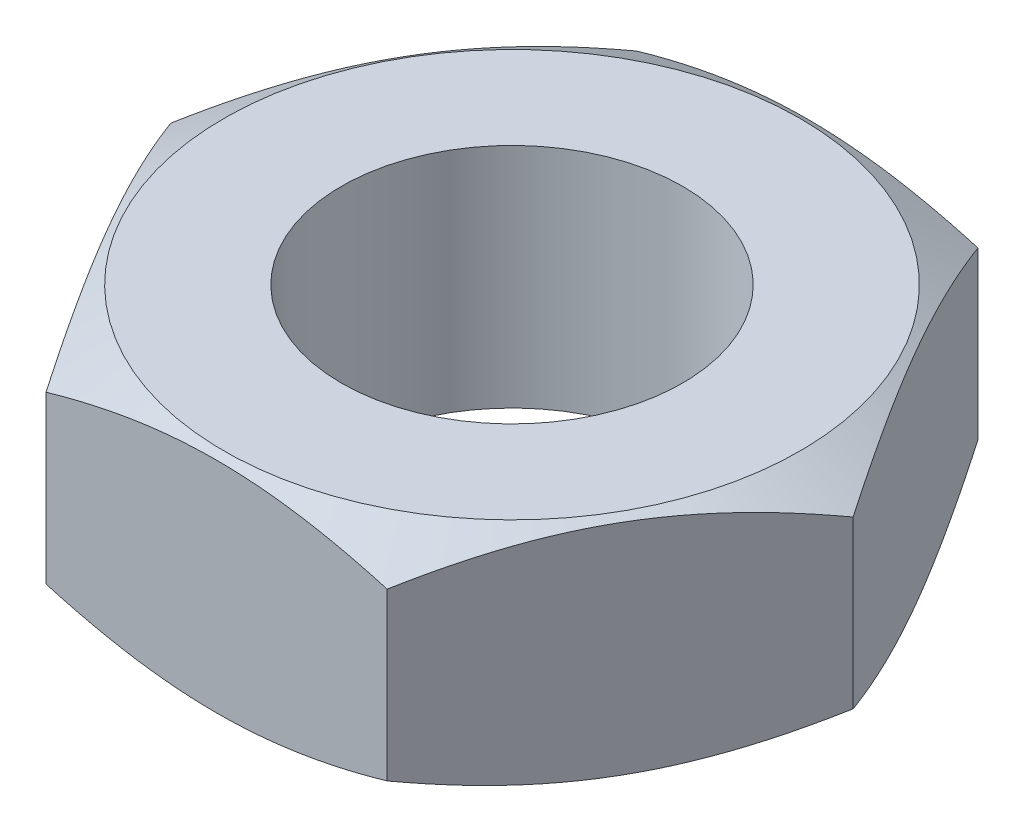
ISO-10303-21;
HEADER;
FILE_DESCRIPTION(('STEP AP214'),'2;1');
FILE_NAME('part.step','',(''),(''),'','','');
FILE_SCHEMA(('AUTOMOTIVE_DESIGN { 1 0 10303 214 1 1 1 1 }'));
ENDSEC;
DATA;
#1=APPLICATION_CONTEXT('core data for automotive mechanical design processes');
#2=APPLICATION_PROTOCOL_DEFINITION('international standard','automotive_design',2000,#1);
#3=PRODUCT_CONTEXT('',#1,'mechanical');
#4=PRODUCT('Part','Part','',(#3));
#5=PRODUCT_RELATED_PRODUCT_CATEGORY('part','',(#4));
#6=PRODUCT_DEFINITION_FORMATION('','',#4);
#7=PRODUCT_DEFINITION_CONTEXT('part definition',#1,'design');
#8=PRODUCT_DEFINITION('design','',#6,#7);
#9=PRODUCT_DEFINITION_SHAPE('','',#8);
#10=(LENGTH_UNIT() NAMED_UNIT(*) SI_UNIT(.MILLI.,.METRE.));
#11=(NAMED_UNIT(*) PLANE_ANGLE_UNIT() SI_UNIT($,.RADIAN.));
#12=(NAMED_UNIT(*) SI_UNIT($,.STERADIAN.) SOLID_ANGLE_UNIT());
#13=UNCERTAINTY_MEASURE_WITH_UNIT(LENGTH_MEASURE(1.E-05),#10,'distance_accuracy_value','');
#14=(GEOMETRIC_REPRESENTATION_CONTEXT(3) GLOBAL_UNCERTAINTY_ASSIGNED_CONTEXT((#13)) GLOBAL_UNIT_ASSIGNED_CONTEXT((#10,
#11,#12)) REPRESENTATION_CONTEXT('',''));
#15=CARTESIAN_POINT('',(0.,0.,0.));
#16=DIRECTION('',(0.,0.,1.));
#17=DIRECTION('',(1.,0.,0.));
#18=AXIS2_PLACEMENT_3D('',#15,#16,#17);
#19=CARTESIAN_POINT('',(-4.5,3.,7.79422863405995));
#20=DIRECTION('',(0.,0.,-1.));
#21=DIRECTION('',(-1.,0.,0.));
#22=AXIS2_PLACEMENT_3D('',#19,#20,#21);
#23=PLANE('',#22);
#24=CARTESIAN_POINT('',(-11.9190953068876,0.834513386120714,7.79422863405995));
#25=CARTESIAN_POINT('',(-11.5770055111038,0.669261417769259,7.79422863405995));
#26=CARTESIAN_POINT('',(-11.2341051453128,0.505656968498226,7.79422863405995));
#27=CARTESIAN_POINT('',(-10.5462449128025,0.182684930652113,7.79422863405995));
#28=CARTESIAN_POINT('',(-10.2012847004182,0.0233180791409778,7.79422863405995));
#29=CARTESIAN_POINT('',(-9.50699523730843,-0.291079909667669,7.79422863405995));
#30=CARTESIAN_POINT('',(-9.15765227127457,-0.446080869188845,7.79422863405995));
#31=CARTESIAN_POINT('',(-8.45608933800493,-0.749402664444385,7.79422863405995));
#32=CARTESIAN_POINT('',(-8.10386952232843,-0.897723849437589,7.79422863405995));
#33=CARTESIAN_POINT('',(-7.39169240053056,-1.1876403219131,7.79422863405995));
#34=CARTESIAN_POINT('',(-7.031693015999,-1.32913281977852,7.79422863405995));
#35=CARTESIAN_POINT('',(-6.30744348045875,-1.60099731893545,7.79422863405995));
#36=CARTESIAN_POINT('',(-5.9431928613815,-1.73136808231962,7.79422863405995));
#37=CARTESIAN_POINT('',(-5.21061020039826,-1.97747418680906,7.79422863405995));
#38=CARTESIAN_POINT('',(-4.84228877364945,-2.09324078028481,7.79422863405995));
#39=CARTESIAN_POINT('',(-4.10042365376642,-2.3063707416378,7.79422863405995));
#40=CARTESIAN_POINT('',(-3.72688165535778,-2.40373993927979,7.79422863405995));
#41=CARTESIAN_POINT('',(-2.9742516252831,-2.57533242392012,7.79422863405995));
#42=CARTESIAN_POINT('',(-2.59516195535838,-2.64954872320258,7.79422863405995));
#43=CARTESIAN_POINT('',(-2.02320526005688,-2.73978340623142,7.79422863405995));
#44=CARTESIAN_POINT('',(-1.83197599415599,-2.76634861042589,7.79422863405995));
#45=CARTESIAN_POINT('',(-1.44862555601179,-2.81192628103252,7.79422863405995));
#46=CARTESIAN_POINT('',(-1.2565044699217,-2.83093946224527,7.79422863405995));
#47=CARTESIAN_POINT('',(-0.872840793740873,-2.86090200878926,7.79422863405995));
#48=CARTESIAN_POINT('',(-0.681302099481684,-2.87190105902582,7.79422863405995));
#49=CARTESIAN_POINT('',(-0.297931320450094,-2.8857774592536,7.79422863405995));
#50=CARTESIAN_POINT('',(-0.106099240135938,-2.88865493145583,7.79422863405995));
#51=CARTESIAN_POINT('',(0.277460073985264,-2.88621970416352,7.79422863405995));
#52=CARTESIAN_POINT('',(0.469187322111202,-2.88090929268128,7.79422863405995));
#53=CARTESIAN_POINT('',(0.852251519599233,-2.86222995157208,7.79422863405995));
#54=CARTESIAN_POINT('',(1.0435884474926,-2.84886059006528,7.79422863405995));
#55=CARTESIAN_POINT('',(1.50768984264631,-2.80693634812311,7.79422863405995));
#56=CARTESIAN_POINT('',(1.78009487217857,-2.77432390777744,7.79422863405995));
#57=CARTESIAN_POINT('',(2.32276046031452,-2.69458384151256,7.79422863405995));
#58=CARTESIAN_POINT('',(2.59302069259299,-2.64745404865777,7.79422863405995));
#59=CARTESIAN_POINT('',(3.4010608581115,-2.48665349667927,7.79422863405995));
#60=CARTESIAN_POINT('',(3.93504330478937,-2.35367917299838,7.79422863405995));
#61=CARTESIAN_POINT('',(4.73376128442028,-2.12452148680951,7.79422863405995));
#62=CARTESIAN_POINT('',(5.00267327672863,-2.04207011337879,7.79422863405995));
#63=CARTESIAN_POINT('',(5.53789951137008,-1.86897724699556,7.79422863405995));
#64=CARTESIAN_POINT('',(5.8042135175318,-1.77833501699558,7.79422863405995));
#65=CARTESIAN_POINT('',(6.33291446917915,-1.59080039287469,7.79422863405995));
#66=CARTESIAN_POINT('',(6.59531509867915,-1.49394618614805,7.79422863405995));
#67=CARTESIAN_POINT('',(7.11788514743953,-1.29464805523161,7.79422863405995));
#68=CARTESIAN_POINT('',(7.37805530765952,-1.19220607771246,7.79422863405995));
#69=CARTESIAN_POINT('',(7.63728662867768,-1.08749367669679,7.79422863405995));
#70=B_SPLINE_CURVE_WITH_KNOTS('',3,(#24,#25,#26,#27,#28,#29,#30,#31,#32,#33,#34,#35,#36,#37,#38,
#39,#40,#41,#42,#43,#44,#45,#46,#47,#48,#49,#50,#51,#52,#53,#54,#55,#56,#57,#58,#59,#60,#61,#62,
#63,#64,#65,#66,#67,#68,#69),.UNSPECIFIED.,.F.,.F.,(4,2,2,2,2,2,2,2,2,2,2,2,2,2,2,2,2,2,2,2,2,2,
4),(0.,1.13975340008177,2.27970376261584,3.42620483893649,4.57264589951385,5.73292449000252,
6.89333205753557,8.05121268150158,9.20872577876855,10.3665878848268,10.9456590654272,
11.5246754237477,12.1000708021209,12.6754575220761,13.2506834858006,13.825940278676,
14.6485234501142,15.4712294641435,17.1198145819317,17.9635544728902,18.807370362835,
19.646420961946,20.4851810962666),.UNSPECIFIED.);
#71=CARTESIAN_POINT('',(4.5,-2.19155678068919,7.79422863405995));
#72=VERTEX_POINT('',#71);
#73=CARTESIAN_POINT('',(-4.5,-2.19155678068919,7.79422863405995));
#74=VERTEX_POINT('',#73);
#75=EDGE_CURVE('E47',#72,#74,#70,.F.);
#76=ORIENTED_EDGE('',*,*,#75,.F.);
#77=DIRECTION('',(0.,-1.,0.));
#78=VECTOR('',#77,1.);
#79=CARTESIAN_POINT('',(4.5,3.,7.79422863405995));
#80=LINE('',#79,#78);
#81=CARTESIAN_POINT('',(4.5,2.19155678068919,7.79422863405995));
#82=VERTEX_POINT('',#81);
#83=EDGE_CURVE('E11',#82,#72,#80,.T.);
#84=ORIENTED_EDGE('',*,*,#83,.F.);
#85=CARTESIAN_POINT('',(-11.9190953068876,-0.834513386120714,7.79422863405995));
#86=CARTESIAN_POINT('',(-11.5770055111038,-0.669261417769259,7.79422863405995));
#87=CARTESIAN_POINT('',(-11.2341051453128,-0.505656968498226,7.79422863405995));
#88=CARTESIAN_POINT('',(-10.5462449128025,-0.182684930652113,7.79422863405995));
#89=CARTESIAN_POINT('',(-10.2012847004182,-0.0233180791409778,7.79422863405995));
#90=CARTESIAN_POINT('',(-9.50699523730843,0.291079909667669,7.79422863405995));
#91=CARTESIAN_POINT('',(-9.15765227127457,0.446080869188845,7.79422863405995));
#92=CARTESIAN_POINT('',(-8.45608933800493,0.749402664444385,7.79422863405995));
#93=CARTESIAN_POINT('',(-8.10386952232843,0.897723849437589,7.79422863405995));
#94=CARTESIAN_POINT('',(-7.39169240053056,1.1876403219131,7.79422863405995));
#95=CARTESIAN_POINT('',(-7.031693015999,1.32913281977852,7.79422863405995));
#96=CARTESIAN_POINT('',(-6.30744348045875,1.60099731893545,7.79422863405995));
#97=CARTESIAN_POINT('',(-5.9431928613815,1.73136808231962,7.79422863405995));
#98=CARTESIAN_POINT('',(-5.21061020039826,1.97747418680906,7.79422863405995));
#99=CARTESIAN_POINT('',(-4.84228877364945,2.09324078028481,7.79422863405995));
#100=CARTESIAN_POINT('',(-4.10042365376642,2.3063707416378,7.79422863405995));
#101=CARTESIAN_POINT('',(-3.72688165535778,2.40373993927979,7.79422863405995));
#102=CARTESIAN_POINT('',(-2.9742516252831,2.57533242392012,7.79422863405995));
#103=CARTESIAN_POINT('',(-2.59516195535838,2.64954872320258,7.79422863405995));
#104=CARTESIAN_POINT('',(-2.02320526005688,2.73978340623142,7.79422863405995));
#105=CARTESIAN_POINT('',(-1.83197599415599,2.76634861042589,7.79422863405995));
#106=CARTESIAN_POINT('',(-1.44862555601179,2.81192628103252,7.79422863405995));
#107=CARTESIAN_POINT('',(-1.2565044699217,2.83093946224527,7.79422863405995));
#108=CARTESIAN_POINT('',(-0.872840793740873,2.86090200878926,7.79422863405995));
#109=CARTESIAN_POINT('',(-0.681302099481684,2.87190105902582,7.79422863405995));
#110=CARTESIAN_POINT('',(-0.297931320450094,2.8857774592536,7.79422863405995));
#111=CARTESIAN_POINT('',(-0.106099240135938,2.88865493145583,7.79422863405995));
#112=CARTESIAN_POINT('',(0.277460073985264,2.88621970416352,7.79422863405995));
#113=CARTESIAN_POINT('',(0.469187322111202,2.88090929268128,7.79422863405995));
#114=CARTESIAN_POINT('',(0.852251519599233,2.86222995157208,7.79422863405995));
#115=CARTESIAN_POINT('',(1.0435884474926,2.84886059006528,7.79422863405995));
#116=CARTESIAN_POINT('',(1.50768984264631,2.80693634812311,7.79422863405995));
#117=CARTESIAN_POINT('',(1.78009487217857,2.77432390777744,7.79422863405995));
#118=CARTESIAN_POINT('',(2.32276046031452,2.69458384151256,7.79422863405995));
#119=CARTESIAN_POINT('',(2.59302069259299,2.64745404865777,7.79422863405995));
#120=CARTESIAN_POINT('',(3.4010608581115,2.48665349667927,7.79422863405995));
#121=CARTESIAN_POINT('',(3.93504330478937,2.35367917299838,7.79422863405995));
#122=CARTESIAN_POINT('',(4.73376128442028,2.12452148680951,7.79422863405995));
#123=CARTESIAN_POINT('',(5.00267327672863,2.04207011337879,7.79422863405995));
#124=CARTESIAN_POINT('',(5.53789951137008,1.86897724699556,7.79422863405995));
#125=CARTESIAN_POINT('',(5.8042135175318,1.77833501699558,7.79422863405995));
#126=CARTESIAN_POINT('',(6.33291446917915,1.59080039287469,7.79422863405995));
#127=CARTESIAN_POINT('',(6.59531509867915,1.49394618614805,7.79422863405995));
#128=CARTESIAN_POINT('',(7.11788514743953,1.29464805523161,7.79422863405995));
#129=CARTESIAN_POINT('',(7.37805530765952,1.19220607771246,7.79422863405995));
#130=CARTESIAN_POINT('',(7.63728662867768,1.08749367669679,7.79422863405995));
#131=B_SPLINE_CURVE_WITH_KNOTS('',3,(#85,#86,#87,#88,#89,#90,#91,#92,#93,#94,#95,#96,#97,#98,
#99,#100,#101,#102,#103,#104,#105,#106,#107,#108,#109,#110,#111,#112,#113,#114,#115,#116,#117,
#118,#119,#120,#121,#122,#123,#124,#125,#126,#127,#128,#129,#130),.UNSPECIFIED.,.F.,.F.,(4,2,2,
2,2,2,2,2,2,2,2,2,2,2,2,2,2,2,2,2,2,2,4),(0.,1.13975340008177,2.27970376261584,3.42620483893649,
4.57264589951385,5.73292449000252,6.89333205753557,8.05121268150158,9.20872577876855,
10.3665878848268,10.9456590654272,11.5246754237477,12.1000708021209,12.6754575220761,
13.2506834858006,13.825940278676,14.6485234501142,15.4712294641435,17.1198145819317,
17.9635544728902,18.807370362835,19.646420961946,20.4851810962666),.UNSPECIFIED.);
#132=CARTESIAN_POINT('',(-4.5,2.19155678068919,7.79422863405995));
#133=VERTEX_POINT('',#132);
#134=EDGE_CURVE('E121',#133,#82,#131,.T.);
#135=ORIENTED_EDGE('',*,*,#134,.F.);
#136=DIRECTION('',(0.,-1.,0.));
#137=VECTOR('',#136,1.);
#138=CARTESIAN_POINT('',(-4.5,3.,7.79422863405995));
#139=LINE('',#138,#137);
#140=EDGE_CURVE('E114',#133,#74,#139,.T.);
#141=ORIENTED_EDGE('',*,*,#140,.T.);
#142=EDGE_LOOP('',(#76,#84,#135,#141));
#143=FACE_BOUND('',#142,.T.);
#144=ADVANCED_FACE('F32',(#143),#23,.F.);
#145=CARTESIAN_POINT('',(4.5,3.,7.79422863405995));
#146=DIRECTION('',(-0.866025403784438,0.,-0.5));
#147=DIRECTION('',(-0.5,0.,0.866025403784439));
#148=AXIS2_PLACEMENT_3D('',#145,#146,#147);
#149=PLANE('',#148);
#150=CARTESIAN_POINT('',(9.00011547005384,-2.19149011273954,-0.000199999999997454));
#151=CARTESIAN_POINT('',(8.90120049129361,-2.24858986602633,0.171125768842321));
#152=CARTESIAN_POINT('',(8.80191672238709,-2.3030982140379,0.343090300955337));
#153=CARTESIAN_POINT('',(8.60254289533803,-2.40621834020498,0.688415899103764));
#154=CARTESIAN_POINT('',(8.50245250907975,-2.45482757466179,0.861777533452297));
#155=CARTESIAN_POINT('',(8.20057875493599,-2.59085242364929,1.38463821310084));
#156=CARTESIAN_POINT('',(7.9976037556743,-2.66822163097211,1.73620122448834));
#157=CARTESIAN_POINT('',(7.69385559146329,-2.75894622900241,2.26230847760759));
#158=CARTESIAN_POINT('',(7.59398986719124,-2.78479105890032,2.43528098598144));
#159=CARTESIAN_POINT('',(7.39380679460617,-2.82812849623535,2.78200823851403));
#160=CARTESIAN_POINT('',(7.29348948698717,-2.8456218416301,2.95576291218866));
#161=CARTESIAN_POINT('',(7.09268213945557,-2.87181296804866,3.30357144064652));
#162=CARTESIAN_POINT('',(6.99219242580223,-2.88052073084807,3.47762473033215));
#163=CARTESIAN_POINT('',(6.79112016523209,-2.88895400714933,3.82589210163237));
#164=CARTESIAN_POINT('',(6.69053762127929,-2.88867979814958,4.00010617811315));
#165=CARTESIAN_POINT('',(6.50249472802536,-2.87977384599742,4.32580602323121));
#166=CARTESIAN_POINT('',(6.41502110941222,-2.8722285197496,4.47731477499107));
#167=CARTESIAN_POINT('',(6.24027843620094,-2.85049092622006,4.77997796324341));
#168=CARTESIAN_POINT('',(6.15300939655361,-2.8362981874781,4.93113237384033));
#169=CARTESIAN_POINT('',(5.89154043779849,-2.7840844202836,5.38400989500633));
#170=CARTESIAN_POINT('',(5.71780334111198,-2.73643434508524,5.68493137362688));
#171=CARTESIAN_POINT('',(5.36848616090657,-2.61730822996126,6.28996647769933));
#172=CARTESIAN_POINT('',(5.19295065980784,-2.54532721063699,6.59400288413439));
#173=CARTESIAN_POINT('',(4.84449737188344,-2.38196000168581,7.19754168288388));
#174=CARTESIAN_POINT('',(4.67157512270785,-2.29061218361377,7.49705180421509));
#175=CARTESIAN_POINT('',(4.49988452994616,-2.19149011273953,7.79442863405995));
#176=B_SPLINE_CURVE_WITH_KNOTS('',3,(#150,#151,#152,#153,#154,#155,#156,#157,#158,#159,#160,
#161,#162,#163,#164,#165,#166,#167,#168,#169,#170,#171,#172,#173,#174,#175),.UNSPECIFIED.,.F.,
.F.,(4,2,2,2,2,2,2,2,2,2,2,2,4),(0.,0.617667126704347,1.23559965230367,2.47403233296678,
3.07808164625473,3.6820775743811,4.28538649467425,4.88867677573061,5.41387548857204,
5.93911145618208,6.99032972891176,8.06486213809553,9.13728513994542),.UNSPECIFIED.);
#177=CARTESIAN_POINT('',(9.,-2.19155678068919,0.));
#178=VERTEX_POINT('',#177);
#179=EDGE_CURVE('E102',#178,#72,#176,.T.);
#180=ORIENTED_EDGE('',*,*,#179,.F.);
#181=DIRECTION('',(0.,-1.,0.));
#182=VECTOR('',#181,1.);
#183=CARTESIAN_POINT('',(9.,3.,0.));
#184=LINE('',#183,#182);
#185=CARTESIAN_POINT('',(9.,2.19155678068919,0.));
#186=VERTEX_POINT('',#185);
#187=EDGE_CURVE('E40',#186,#178,#184,.T.);
#188=ORIENTED_EDGE('',*,*,#187,.F.);
#189=CARTESIAN_POINT('',(4.49988452994616,2.19149011273953,7.79442863405995));
#190=CARTESIAN_POINT('',(4.59879950870639,2.24858986602633,7.62310286521763));
#191=CARTESIAN_POINT('',(4.69808327761291,2.3030982140379,7.45113833310462));
#192=CARTESIAN_POINT('',(4.89745710466197,2.40621834020498,7.10581273495619));
#193=CARTESIAN_POINT('',(4.99754749092025,2.45482757466179,6.93245110060766));
#194=CARTESIAN_POINT('',(5.29942124506401,2.59085242364929,6.40959042095912));
#195=CARTESIAN_POINT('',(5.5023962443257,2.66822163097211,6.05802740957161));
#196=CARTESIAN_POINT('',(5.80614440853671,2.75894622900241,5.53192015645237));
#197=CARTESIAN_POINT('',(5.90601013280876,2.78479105890032,5.35894764807852));
#198=CARTESIAN_POINT('',(6.10619320539383,2.82812849623534,5.01222039554592));
#199=CARTESIAN_POINT('',(6.20651051301283,2.8456218416301,4.8384657218713));
#200=CARTESIAN_POINT('',(6.40731786054443,2.87181296804866,4.49065719341343));
#201=CARTESIAN_POINT('',(6.50780757419777,2.88052073084807,4.3166039037278));
#202=CARTESIAN_POINT('',(6.70887983476791,2.88895400714933,3.96833653242759));
#203=CARTESIAN_POINT('',(6.80946237872071,2.88867979814958,3.79412245594681));
#204=CARTESIAN_POINT('',(6.99750527197464,2.87977384599742,3.46842261082874));
#205=CARTESIAN_POINT('',(7.08497889058778,2.8722285197496,3.31691385906888));
#206=CARTESIAN_POINT('',(7.25972156379906,2.85049092622006,3.01425067081654));
#207=CARTESIAN_POINT('',(7.34699060344639,2.8362981874781,2.86309626021963));
#208=CARTESIAN_POINT('',(7.60845956220151,2.7840844202836,2.41021873905363));
#209=CARTESIAN_POINT('',(7.78219665888802,2.73643434508524,2.10929726043308));
#210=CARTESIAN_POINT('',(8.13151383909343,2.61730822996126,1.50426215636062));
#211=CARTESIAN_POINT('',(8.30704934019216,2.54532721063699,1.20022574992556));
#212=CARTESIAN_POINT('',(8.65550262811656,2.38196000168581,0.596686951176075));
#213=CARTESIAN_POINT('',(8.82842487729215,2.29061218361377,0.297176829844865));
#214=CARTESIAN_POINT('',(9.00011547005384,2.19149011273954,-0.000199999999996476));
#215=B_SPLINE_CURVE_WITH_KNOTS('',3,(#189,#190,#191,#192,#193,#194,#195,#196,#197,#198,#199,
#200,#201,#202,#203,#204,#205,#206,#207,#208,#209,#210,#211,#212,#213,#214),.UNSPECIFIED.,.F.,
.F.,(4,2,2,2,2,2,2,2,2,2,2,2,4),(0.,0.617667126704346,1.23559965230366,2.47403233296678,
3.07808164625473,3.6820775743811,4.28538649467425,4.88867677573061,5.41387548857204,
5.93911145618208,6.99032972891176,8.06486213809553,9.13728513994542),.UNSPECIFIED.);
#216=EDGE_CURVE('E129',#82,#186,#215,.T.);
#217=ORIENTED_EDGE('',*,*,#216,.F.);
#218=ORIENTED_EDGE('',*,*,#83,.T.);
#219=EDGE_LOOP('',(#180,#188,#217,#218));
#220=FACE_BOUND('',#219,.T.);
#221=ADVANCED_FACE('F172',(#220),#149,.F.);
#222=CARTESIAN_POINT('',(9.,3.,0.));
#223=DIRECTION('',(-0.866025403784439,0.,0.5));
#224=DIRECTION('',(0.5,0.,0.866025403784439));
#225=AXIS2_PLACEMENT_3D('',#222,#223,#224);
#226=PLANE('',#225);
#227=CARTESIAN_POINT('',(4.49988452994616,-2.19149011273953,-7.79442863405995));
#228=CARTESIAN_POINT('',(4.5987995087064,-2.24858986602633,-7.62310286521763));
#229=CARTESIAN_POINT('',(4.69808327761291,-2.3030982140379,-7.45113833310462));
#230=CARTESIAN_POINT('',(4.89745710466197,-2.40621834020498,-7.10581273495619));
#231=CARTESIAN_POINT('',(4.99754749092025,-2.45482757466179,-6.93245110060766));
#232=CARTESIAN_POINT('',(5.29942124506401,-2.59085242364929,-6.40959042095912));
#233=CARTESIAN_POINT('',(5.5023962443257,-2.66822163097211,-6.05802740957161));
#234=CARTESIAN_POINT('',(5.80614440853671,-2.75894622900241,-5.53192015645236));
#235=CARTESIAN_POINT('',(5.90601013280876,-2.78479105890032,-5.35894764807852));
#236=CARTESIAN_POINT('',(6.10619320539383,-2.82812849623535,-5.01222039554592));
#237=CARTESIAN_POINT('',(6.20651051301283,-2.8456218416301,-4.83846572187129));
#238=CARTESIAN_POINT('',(6.40731786054443,-2.87181296804866,-4.49065719341343));
#239=CARTESIAN_POINT('',(6.50780757419777,-2.88052073084807,-4.3166039037278));
#240=CARTESIAN_POINT('',(6.70887983476791,-2.88895400714933,-3.96833653242759));
#241=CARTESIAN_POINT('',(6.80946237872071,-2.88867979814958,-3.7941224559468));
#242=CARTESIAN_POINT('',(6.99750527197464,-2.87977384599742,-3.46842261082874));
#243=CARTESIAN_POINT('',(7.08497889058778,-2.8722285197496,-3.31691385906888));
#244=CARTESIAN_POINT('',(7.25972156379906,-2.85049092622006,-3.01425067081654));
#245=CARTESIAN_POINT('',(7.34699060344639,-2.8362981874781,-2.86309626021962));
#246=CARTESIAN_POINT('',(7.60845956220151,-2.7840844202836,-2.41021873905362));
#247=CARTESIAN_POINT('',(7.78219665888802,-2.73643434508524,-2.10929726043308));
#248=CARTESIAN_POINT('',(8.13151383909343,-2.61730822996126,-1.50426215636062));
#249=CARTESIAN_POINT('',(8.30704934019216,-2.54532721063699,-1.20022574992556));
#250=CARTESIAN_POINT('',(8.65550262811656,-2.38196000168581,-0.596686951176069));
#251=CARTESIAN_POINT('',(8.82842487729215,-2.29061218361377,-0.297176829844858));
#252=CARTESIAN_POINT('',(9.00011547005384,-2.19149011273954,0.000200000000002919));
#253=B_SPLINE_CURVE_WITH_KNOTS('',3,(#227,#228,#229,#230,#231,#232,#233,#234,#235,#236,#237,
#238,#239,#240,#241,#242,#243,#244,#245,#246,#247,#248,#249,#250,#251,#252),.UNSPECIFIED.,.F.,
.F.,(4,2,2,2,2,2,2,2,2,2,2,2,4),(0.,0.617667126704345,1.23559965230366,2.47403233296678,
3.07808164625473,3.6820775743811,4.28538649467425,4.88867677573061,5.41387548857204,
5.93911145618208,6.99032972891176,8.06486213809553,9.13728513994543),.UNSPECIFIED.);
#254=CARTESIAN_POINT('',(4.5,-2.19155678068919,-7.79422863405995));
#255=VERTEX_POINT('',#254);
#256=EDGE_CURVE('E86',#255,#178,#253,.T.);
#257=ORIENTED_EDGE('',*,*,#256,.F.);
#258=DIRECTION('',(0.,-1.,0.));
#259=VECTOR('',#258,1.);
#260=CARTESIAN_POINT('',(4.5,3.,-7.79422863405995));
#261=LINE('',#260,#259);
#262=CARTESIAN_POINT('',(4.5,2.19155678068919,-7.79422863405995));
#263=VERTEX_POINT('',#262);
#264=EDGE_CURVE('E100',#263,#255,#261,.T.);
#265=ORIENTED_EDGE('',*,*,#264,.F.);
#266=CARTESIAN_POINT('',(9.00011547005384,2.19149011273954,0.000200000000002611));
#267=CARTESIAN_POINT('',(8.90120049129361,2.24858986602633,-0.171125768842316));
#268=CARTESIAN_POINT('',(8.80191672238709,2.3030982140379,-0.343090300955332));
#269=CARTESIAN_POINT('',(8.60254289533803,2.40621834020498,-0.688415899103759));
#270=CARTESIAN_POINT('',(8.50245250907975,2.45482757466179,-0.861777533452292));
#271=CARTESIAN_POINT('',(8.20057875493599,2.59085242364929,-1.38463821310083));
#272=CARTESIAN_POINT('',(7.9976037556743,2.6682216309721,-1.73620122448834));
#273=CARTESIAN_POINT('',(7.69385559146329,2.75894622900241,-2.26230847760758));
#274=CARTESIAN_POINT('',(7.59398986719124,2.78479105890032,-2.43528098598143));
#275=CARTESIAN_POINT('',(7.39380679460617,2.82812849623535,-2.78200823851403));
#276=CARTESIAN_POINT('',(7.29348948698717,2.8456218416301,-2.95576291218865));
#277=CARTESIAN_POINT('',(7.09268213945557,2.87181296804866,-3.30357144064652));
#278=CARTESIAN_POINT('',(6.99219242580223,2.88052073084807,-3.47762473033215));
#279=CARTESIAN_POINT('',(6.79112016523209,2.88895400714933,-3.82589210163236));
#280=CARTESIAN_POINT('',(6.69053762127929,2.88867979814958,-4.00010617811314));
#281=CARTESIAN_POINT('',(6.50249472802536,2.87977384599742,-4.32580602323121));
#282=CARTESIAN_POINT('',(6.41502110941222,2.8722285197496,-4.47731477499107));
#283=CARTESIAN_POINT('',(6.24027843620094,2.85049092622006,-4.77997796324341));
#284=CARTESIAN_POINT('',(6.15300939655361,2.8362981874781,-4.93113237384032));
#285=CARTESIAN_POINT('',(5.89154043779849,2.78408442028361,-5.38400989500632));
#286=CARTESIAN_POINT('',(5.71780334111198,2.73643434508524,-5.68493137362687));
#287=CARTESIAN_POINT('',(5.36848616090657,2.61730822996126,-6.28996647769933));
#288=CARTESIAN_POINT('',(5.19295065980784,2.54532721063699,-6.59400288413439));
#289=CARTESIAN_POINT('',(4.84449737188344,2.38196000168581,-7.19754168288388));
#290=CARTESIAN_POINT('',(4.67157512270785,2.29061218361377,-7.49705180421509));
#291=CARTESIAN_POINT('',(4.49988452994616,2.19149011273953,-7.79442863405995));
#292=B_SPLINE_CURVE_WITH_KNOTS('',3,(#266,#267,#268,#269,#270,#271,#272,#273,#274,#275,#276,
#277,#278,#279,#280,#281,#282,#283,#284,#285,#286,#287,#288,#289,#290,#291),.UNSPECIFIED.,.F.,
.F.,(4,2,2,2,2,2,2,2,2,2,2,2,4),(0.,0.617667126704347,1.23559965230367,2.47403233296678,
3.07808164625473,3.6820775743811,4.28538649467425,4.88867677573061,5.41387548857204,
5.93911145618208,6.99032972891176,8.06486213809553,9.13728513994543),.UNSPECIFIED.);
#293=EDGE_CURVE('E165',#186,#263,#292,.T.);
#294=ORIENTED_EDGE('',*,*,#293,.F.);
#295=ORIENTED_EDGE('',*,*,#187,.T.);
#296=EDGE_LOOP('',(#257,#265,#294,#295));
#297=FACE_BOUND('',#296,.T.);
#298=ADVANCED_FACE('F98',(#297),#226,.F.);
#299=CARTESIAN_POINT('',(4.5,3.,-7.79422863405995));
#300=DIRECTION('',(0.,0.,1.));
#301=DIRECTION('',(1.,0.,0.));
#302=AXIS2_PLACEMENT_3D('',#299,#300,#301);
#303=PLANE('',#302);
#304=CARTESIAN_POINT('',(-11.9190953068876,0.834513386120714,-7.79422863405995));
#305=CARTESIAN_POINT('',(-11.5770055111038,0.66926141776926,-7.79422863405995));
#306=CARTESIAN_POINT('',(-11.2341051453128,0.505656968498228,-7.79422863405995));
#307=CARTESIAN_POINT('',(-10.5462449128025,0.182684930652115,-7.79422863405995));
#308=CARTESIAN_POINT('',(-10.2012847004182,0.02331807914098,-7.79422863405995));
#309=CARTESIAN_POINT('',(-9.50699523730843,-0.291079909667667,-7.79422863405995));
#310=CARTESIAN_POINT('',(-9.15765227127457,-0.446080869188844,-7.79422863405995));
#311=CARTESIAN_POINT('',(-8.45608933800493,-0.749402664444383,-7.79422863405995));
#312=CARTESIAN_POINT('',(-8.10386952232844,-0.897723849437586,-7.79422863405995));
#313=CARTESIAN_POINT('',(-7.39169240053056,-1.1876403219131,-7.79422863405995));
#314=CARTESIAN_POINT('',(-7.031693015999,-1.32913281977852,-7.79422863405995));
#315=CARTESIAN_POINT('',(-6.30744348045876,-1.60099731893544,-7.79422863405995));
#316=CARTESIAN_POINT('',(-5.9431928613815,-1.73136808231962,-7.79422863405995));
#317=CARTESIAN_POINT('',(-5.21061020039826,-1.97747418680906,-7.79422863405995));
#318=CARTESIAN_POINT('',(-4.84228877364945,-2.09324078028481,-7.79422863405995));
#319=CARTESIAN_POINT('',(-4.10042365376641,-2.3063707416378,-7.79422863405995));
#320=CARTESIAN_POINT('',(-3.72688165535777,-2.40373993927979,-7.79422863405995));
#321=CARTESIAN_POINT('',(-2.9742516252831,-2.57533242392012,-7.79422863405995));
#322=CARTESIAN_POINT('',(-2.59516195535838,-2.64954872320258,-7.79422863405995));
#323=CARTESIAN_POINT('',(-2.02320526005688,-2.73978340623142,-7.79422863405995));
#324=CARTESIAN_POINT('',(-1.83197599415599,-2.76634861042589,-7.79422863405995));
#325=CARTESIAN_POINT('',(-1.44862555601178,-2.81192628103252,-7.79422863405995));
#326=CARTESIAN_POINT('',(-1.2565044699217,-2.83093946224527,-7.79422863405995));
#327=CARTESIAN_POINT('',(-0.872840793740868,-2.86090200878926,-7.79422863405995));
#328=CARTESIAN_POINT('',(-0.681302099481679,-2.87190105902582,-7.79422863405995));
#329=CARTESIAN_POINT('',(-0.297931320450089,-2.8857774592536,-7.79422863405995));
#330=CARTESIAN_POINT('',(-0.106099240135932,-2.88865493145583,-7.79422863405995));
#331=CARTESIAN_POINT('',(0.277460073985269,-2.88621970416352,-7.79422863405995));
#332=CARTESIAN_POINT('',(0.469187322111207,-2.88090929268128,-7.79422863405995));
#333=CARTESIAN_POINT('',(0.852251519599238,-2.86222995157208,-7.79422863405995));
#334=CARTESIAN_POINT('',(1.04358844749261,-2.84886059006528,-7.79422863405995));
#335=CARTESIAN_POINT('',(1.50768984264631,-2.80693634812311,-7.79422863405995));
#336=CARTESIAN_POINT('',(1.78009487217857,-2.77432390777744,-7.79422863405995));
#337=CARTESIAN_POINT('',(2.32276046031452,-2.69458384151256,-7.79422863405995));
#338=CARTESIAN_POINT('',(2.593020692593,-2.64745404865777,-7.79422863405995));
#339=CARTESIAN_POINT('',(3.4010608581115,-2.48665349667927,-7.79422863405995));
#340=CARTESIAN_POINT('',(3.93504330478937,-2.35367917299838,-7.79422863405995));
#341=CARTESIAN_POINT('',(4.73376128442028,-2.12452148680951,-7.79422863405995));
#342=CARTESIAN_POINT('',(5.00267327672863,-2.04207011337879,-7.79422863405995));
#343=CARTESIAN_POINT('',(5.53789951137008,-1.86897724699556,-7.79422863405995));
#344=CARTESIAN_POINT('',(5.80421351753181,-1.77833501699558,-7.79422863405995));
#345=CARTESIAN_POINT('',(6.33291446917915,-1.59080039287469,-7.79422863405995));
#346=CARTESIAN_POINT('',(6.59531509867916,-1.49394618614805,-7.79422863405995));
#347=CARTESIAN_POINT('',(7.11788514743954,-1.29464805523161,-7.79422863405995));
#348=CARTESIAN_POINT('',(7.37805530765953,-1.19220607771246,-7.79422863405995));
#349=CARTESIAN_POINT('',(7.63728662867769,-1.08749367669679,-7.79422863405995));
#350=B_SPLINE_CURVE_WITH_KNOTS('',3,(#304,#305,#306,#307,#308,#309,#310,#311,#312,#313,#314,
#315,#316,#317,#318,#319,#320,#321,#322,#323,#324,#325,#326,#327,#328,#329,#330,#331,#332,#333,
#334,#335,#336,#337,#338,#339,#340,#341,#342,#343,#344,#345,#346,#347,#348,#349),.UNSPECIFIED.,
.F.,.F.,(4,2,2,2,2,2,2,2,2,2,2,2,2,2,2,2,2,2,2,2,2,2,4),(0.,1.13975340008177,2.27970376261583,
3.42620483893649,4.57264589951385,5.73292449000251,6.89333205753557,8.05121268150158,
9.20872577876855,10.3665878848268,10.9456590654272,11.5246754237477,12.1000708021209,
12.6754575220761,13.2506834858007,13.825940278676,14.6485234501142,15.4712294641435,
17.1198145819317,17.9635544728902,18.807370362835,19.646420961946,20.4851810962666),.UNSPECIFIED.);
#351=CARTESIAN_POINT('',(-4.5,-2.19155678068919,-7.79422863405995));
#352=VERTEX_POINT('',#351);
#353=EDGE_CURVE('E83',#352,#255,#350,.T.);
#354=ORIENTED_EDGE('',*,*,#353,.F.);
#355=DIRECTION('',(0.,-1.,0.));
#356=VECTOR('',#355,1.);
#357=CARTESIAN_POINT('',(-4.5,3.,-7.79422863405995));
#358=LINE('',#357,#356);
#359=CARTESIAN_POINT('',(-4.5,2.19155678068919,-7.79422863405995));
#360=VERTEX_POINT('',#359);
#361=EDGE_CURVE('E107',#360,#352,#358,.T.);
#362=ORIENTED_EDGE('',*,*,#361,.F.);
#363=CARTESIAN_POINT('',(-11.9190953068876,-0.834513386120714,-7.79422863405995));
#364=CARTESIAN_POINT('',(-11.5770055111038,-0.66926141776926,-7.79422863405995));
#365=CARTESIAN_POINT('',(-11.2341051453128,-0.505656968498228,-7.79422863405995));
#366=CARTESIAN_POINT('',(-10.5462449128025,-0.182684930652115,-7.79422863405995));
#367=CARTESIAN_POINT('',(-10.2012847004182,-0.02331807914098,-7.79422863405995));
#368=CARTESIAN_POINT('',(-9.50699523730843,0.291079909667667,-7.79422863405995));
#369=CARTESIAN_POINT('',(-9.15765227127457,0.446080869188844,-7.79422863405995));
#370=CARTESIAN_POINT('',(-8.45608933800493,0.749402664444383,-7.79422863405995));
#371=CARTESIAN_POINT('',(-8.10386952232844,0.897723849437586,-7.79422863405995));
#372=CARTESIAN_POINT('',(-7.39169240053056,1.1876403219131,-7.79422863405995));
#373=CARTESIAN_POINT('',(-7.031693015999,1.32913281977852,-7.79422863405995));
#374=CARTESIAN_POINT('',(-6.30744348045876,1.60099731893544,-7.79422863405995));
#375=CARTESIAN_POINT('',(-5.9431928613815,1.73136808231962,-7.79422863405995));
#376=CARTESIAN_POINT('',(-5.21061020039826,1.97747418680906,-7.79422863405995));
#377=CARTESIAN_POINT('',(-4.84228877364945,2.09324078028481,-7.79422863405995));
#378=CARTESIAN_POINT('',(-4.10042365376641,2.3063707416378,-7.79422863405995));
#379=CARTESIAN_POINT('',(-3.72688165535777,2.40373993927979,-7.79422863405995));
#380=CARTESIAN_POINT('',(-2.9742516252831,2.57533242392012,-7.79422863405995));
#381=CARTESIAN_POINT('',(-2.59516195535838,2.64954872320258,-7.79422863405995));
#382=CARTESIAN_POINT('',(-2.02320526005688,2.73978340623142,-7.79422863405995));
#383=CARTESIAN_POINT('',(-1.83197599415599,2.76634861042589,-7.79422863405995));
#384=CARTESIAN_POINT('',(-1.44862555601178,2.81192628103252,-7.79422863405995));
#385=CARTESIAN_POINT('',(-1.2565044699217,2.83093946224527,-7.79422863405995));
#386=CARTESIAN_POINT('',(-0.872840793740868,2.86090200878926,-7.79422863405995));
#387=CARTESIAN_POINT('',(-0.681302099481679,2.87190105902582,-7.79422863405995));
#388=CARTESIAN_POINT('',(-0.297931320450089,2.8857774592536,-7.79422863405995));
#389=CARTESIAN_POINT('',(-0.106099240135932,2.88865493145583,-7.79422863405995));
#390=CARTESIAN_POINT('',(0.277460073985269,2.88621970416352,-7.79422863405995));
#391=CARTESIAN_POINT('',(0.469187322111207,2.88090929268128,-7.79422863405995));
#392=CARTESIAN_POINT('',(0.852251519599238,2.86222995157208,-7.79422863405995));
#393=CARTESIAN_POINT('',(1.04358844749261,2.84886059006528,-7.79422863405995));
#394=CARTESIAN_POINT('',(1.50768984264631,2.80693634812311,-7.79422863405995));
#395=CARTESIAN_POINT('',(1.78009487217857,2.77432390777744,-7.79422863405995));
#396=CARTESIAN_POINT('',(2.32276046031452,2.69458384151256,-7.79422863405995));
#397=CARTESIAN_POINT('',(2.593020692593,2.64745404865777,-7.79422863405995));
#398=CARTESIAN_POINT('',(3.4010608581115,2.48665349667927,-7.79422863405995));
#399=CARTESIAN_POINT('',(3.93504330478937,2.35367917299838,-7.79422863405995));
#400=CARTESIAN_POINT('',(4.73376128442028,2.12452148680951,-7.79422863405995));
#401=CARTESIAN_POINT('',(5.00267327672863,2.04207011337879,-7.79422863405995));
#402=CARTESIAN_POINT('',(5.53789951137008,1.86897724699556,-7.79422863405995));
#403=CARTESIAN_POINT('',(5.80421351753181,1.77833501699558,-7.79422863405995));
#404=CARTESIAN_POINT('',(6.33291446917915,1.59080039287469,-7.79422863405995));
#405=CARTESIAN_POINT('',(6.59531509867916,1.49394618614805,-7.79422863405995));
#406=CARTESIAN_POINT('',(7.11788514743954,1.29464805523161,-7.79422863405995));
#407=CARTESIAN_POINT('',(7.37805530765953,1.19220607771246,-7.79422863405995));
#408=CARTESIAN_POINT('',(7.63728662867769,1.08749367669679,-7.79422863405995));
#409=B_SPLINE_CURVE_WITH_KNOTS('',3,(#363,#364,#365,#366,#367,#368,#369,#370,#371,#372,#373,
#374,#375,#376,#377,#378,#379,#380,#381,#382,#383,#384,#385,#386,#387,#388,#389,#390,#391,#392,
#393,#394,#395,#396,#397,#398,#399,#400,#401,#402,#403,#404,#405,#406,#407,#408),.UNSPECIFIED.,
.F.,.F.,(4,2,2,2,2,2,2,2,2,2,2,2,2,2,2,2,2,2,2,2,2,2,4),(0.,1.13975340008177,2.27970376261583,
3.42620483893649,4.57264589951385,5.73292449000251,6.89333205753557,8.05121268150158,
9.20872577876855,10.3665878848268,10.9456590654272,11.5246754237477,12.1000708021209,
12.6754575220761,13.2506834858007,13.825940278676,14.6485234501142,15.4712294641435,
17.1198145819317,17.9635544728902,18.807370362835,19.646420961946,20.4851810962666),.UNSPECIFIED.);
#410=EDGE_CURVE('E106',#263,#360,#409,.F.);
#411=ORIENTED_EDGE('',*,*,#410,.F.);
#412=ORIENTED_EDGE('',*,*,#264,.T.);
#413=EDGE_LOOP('',(#354,#362,#411,#412));
#414=FACE_BOUND('',#413,.T.);
#415=ADVANCED_FACE('F105',(#414),#303,.F.);
#416=CARTESIAN_POINT('',(-4.5,3.,-7.79422863405995));
#417=DIRECTION('',(0.866025403784439,0.,0.5));
#418=DIRECTION('',(0.5,0.,-0.866025403784439));
#419=AXIS2_PLACEMENT_3D('',#416,#417,#418);
#420=PLANE('',#419);
#421=CARTESIAN_POINT('',(-9.00011547005384,-2.19149011273954,0.000200000000000536));
#422=CARTESIAN_POINT('',(-8.90120049129361,-2.24858986602633,-0.171125768842318));
#423=CARTESIAN_POINT('',(-8.80191672238709,-2.3030982140379,-0.343090300955334));
#424=CARTESIAN_POINT('',(-8.60254289533803,-2.40621834020498,-0.688415899103761));
#425=CARTESIAN_POINT('',(-8.50245250907975,-2.45482757466179,-0.861777533452293));
#426=CARTESIAN_POINT('',(-8.20057875493599,-2.59085242364929,-1.38463821310083));
#427=CARTESIAN_POINT('',(-7.9976037556743,-2.6682216309721,-1.73620122448834));
#428=CARTESIAN_POINT('',(-7.69385559146329,-2.75894622900241,-2.26230847760759));
#429=CARTESIAN_POINT('',(-7.59398986719124,-2.78479105890032,-2.43528098598143));
#430=CARTESIAN_POINT('',(-7.39380679460617,-2.82812849623535,-2.78200823851403));
#431=CARTESIAN_POINT('',(-7.29348948698717,-2.8456218416301,-2.95576291218865));
#432=CARTESIAN_POINT('',(-7.09268213945557,-2.87181296804866,-3.30357144064652));
#433=CARTESIAN_POINT('',(-6.99219242580223,-2.88052073084807,-3.47762473033215));
#434=CARTESIAN_POINT('',(-6.79112016523209,-2.88895400714933,-3.82589210163236));
#435=CARTESIAN_POINT('',(-6.69053762127929,-2.88867979814958,-4.00010617811314));
#436=CARTESIAN_POINT('',(-6.50249472802536,-2.87977384599742,-4.32580602323121));
#437=CARTESIAN_POINT('',(-6.41502110941222,-2.8722285197496,-4.47731477499107));
#438=CARTESIAN_POINT('',(-6.24027843620094,-2.85049092622006,-4.77997796324341));
#439=CARTESIAN_POINT('',(-6.15300939655361,-2.8362981874781,-4.93113237384032));
#440=CARTESIAN_POINT('',(-5.89154043779849,-2.78408442028361,-5.38400989500633));
#441=CARTESIAN_POINT('',(-5.71780334111197,-2.73643434508524,-5.68493137362687));
#442=CARTESIAN_POINT('',(-5.36848616090657,-2.61730822996126,-6.28996647769933));
#443=CARTESIAN_POINT('',(-5.19295065980784,-2.54532721063699,-6.59400288413439));
#444=CARTESIAN_POINT('',(-4.84449737188344,-2.38196000168581,-7.19754168288388));
#445=CARTESIAN_POINT('',(-4.67157512270785,-2.29061218361377,-7.49705180421509));
#446=CARTESIAN_POINT('',(-4.49988452994616,-2.19149011273954,-7.79442863405995));
#447=B_SPLINE_CURVE_WITH_KNOTS('',3,(#421,#422,#423,#424,#425,#426,#427,#428,#429,#430,#431,
#432,#433,#434,#435,#436,#437,#438,#439,#440,#441,#442,#443,#444,#445,#446),.UNSPECIFIED.,.F.,
.F.,(4,2,2,2,2,2,2,2,2,2,2,2,4),(0.,0.617667126704347,1.23559965230366,2.47403233296678,
3.07808164625473,3.6820775743811,4.28538649467425,4.88867677573061,5.41387548857204,
5.93911145618208,6.99032972891176,8.06486213809553,9.13728513994543),.UNSPECIFIED.);
#448=CARTESIAN_POINT('',(-9.,-2.19155678068919,0.));
#449=VERTEX_POINT('',#448);
#450=EDGE_CURVE('E89',#449,#352,#447,.T.);
#451=ORIENTED_EDGE('',*,*,#450,.F.);
#452=DIRECTION('',(0.,-1.,0.));
#453=VECTOR('',#452,1.);
#454=CARTESIAN_POINT('',(-9.,3.,0.));
#455=LINE('',#454,#453);
#456=CARTESIAN_POINT('',(-9.,2.19155678068919,0.));
#457=VERTEX_POINT('',#456);
#458=EDGE_CURVE('E109',#457,#449,#455,.T.);
#459=ORIENTED_EDGE('',*,*,#458,.F.);
#460=CARTESIAN_POINT('',(-4.49988452994616,2.19149011273954,-7.79442863405995));
#461=CARTESIAN_POINT('',(-4.59879950870639,2.24858986602633,-7.62310286521763));
#462=CARTESIAN_POINT('',(-4.69808327761291,2.3030982140379,-7.45113833310462));
#463=CARTESIAN_POINT('',(-4.89745710466197,2.40621834020498,-7.10581273495619));
#464=CARTESIAN_POINT('',(-4.99754749092025,2.45482757466179,-6.93245110060766));
#465=CARTESIAN_POINT('',(-5.299421245064,2.59085242364929,-6.40959042095912));
#466=CARTESIAN_POINT('',(-5.5023962443257,2.66822163097211,-6.05802740957161));
#467=CARTESIAN_POINT('',(-5.80614440853671,2.75894622900241,-5.53192015645237));
#468=CARTESIAN_POINT('',(-5.90601013280875,2.78479105890032,-5.35894764807852));
#469=CARTESIAN_POINT('',(-6.10619320539383,2.82812849623535,-5.01222039554592));
#470=CARTESIAN_POINT('',(-6.20651051301283,2.8456218416301,-4.8384657218713));
#471=CARTESIAN_POINT('',(-6.40731786054443,2.87181296804866,-4.49065719341343));
#472=CARTESIAN_POINT('',(-6.50780757419776,2.88052073084807,-4.3166039037278));
#473=CARTESIAN_POINT('',(-6.70887983476791,2.88895400714933,-3.96833653242759));
#474=CARTESIAN_POINT('',(-6.80946237872071,2.88867979814958,-3.79412245594681));
#475=CARTESIAN_POINT('',(-6.99750527197464,2.87977384599742,-3.46842261082875));
#476=CARTESIAN_POINT('',(-7.08497889058778,2.8722285197496,-3.31691385906889));
#477=CARTESIAN_POINT('',(-7.25972156379906,2.85049092622006,-3.01425067081654));
#478=CARTESIAN_POINT('',(-7.34699060344639,2.8362981874781,-2.86309626021963));
#479=CARTESIAN_POINT('',(-7.60845956220151,2.78408442028361,-2.41021873905363));
#480=CARTESIAN_POINT('',(-7.78219665888802,2.73643434508524,-2.10929726043308));
#481=CARTESIAN_POINT('',(-8.13151383909343,2.61730822996126,-1.50426215636062));
#482=CARTESIAN_POINT('',(-8.30704934019216,2.54532721063699,-1.20022574992556));
#483=CARTESIAN_POINT('',(-8.65550262811656,2.38196000168581,-0.596686951176072));
#484=CARTESIAN_POINT('',(-8.82842487729215,2.29061218361377,-0.297176829844862));
#485=CARTESIAN_POINT('',(-9.00011547005384,2.19149011273954,0.000199999999998906));
#486=B_SPLINE_CURVE_WITH_KNOTS('',3,(#460,#461,#462,#463,#464,#465,#466,#467,#468,#469,#470,
#471,#472,#473,#474,#475,#476,#477,#478,#479,#480,#481,#482,#483,#484,#485),.UNSPECIFIED.,.F.,
.F.,(4,2,2,2,2,2,2,2,2,2,2,2,4),(0.,0.617667126704346,1.23559965230366,2.47403233296678,
3.07808164625473,3.6820775743811,4.28538649467425,4.88867677573061,5.41387548857204,
5.93911145618208,6.99032972891176,8.06486213809553,9.13728513994543),.UNSPECIFIED.);
#487=EDGE_CURVE('E55',#360,#457,#486,.T.);
#488=ORIENTED_EDGE('',*,*,#487,.F.);
#489=ORIENTED_EDGE('',*,*,#361,.T.);
#490=EDGE_LOOP('',(#451,#459,#488,#489));
#491=FACE_BOUND('',#490,.T.);
#492=ADVANCED_FACE('F197',(#491),#420,.F.);
#493=CARTESIAN_POINT('',(-9.,3.,0.));
#494=DIRECTION('',(0.866025403784439,0.,-0.5));
#495=DIRECTION('',(-0.5,0.,-0.866025403784439));
#496=AXIS2_PLACEMENT_3D('',#493,#494,#495);
#497=PLANE('',#496);
#498=CARTESIAN_POINT('',(-4.49988452994616,-2.19149011273953,7.79442863405995));
#499=CARTESIAN_POINT('',(-4.5987995087064,-2.24858986602633,7.62310286521763));
#500=CARTESIAN_POINT('',(-4.69808327761291,-2.3030982140379,7.45113833310462));
#501=CARTESIAN_POINT('',(-4.89745710466198,-2.40621834020498,7.10581273495619));
#502=CARTESIAN_POINT('',(-4.99754749092025,-2.45482757466179,6.93245110060766));
#503=CARTESIAN_POINT('',(-5.29942124506401,-2.59085242364929,6.40959042095912));
#504=CARTESIAN_POINT('',(-5.5023962443257,-2.6682216309721,6.05802740957161));
#505=CARTESIAN_POINT('',(-5.80614440853672,-2.75894622900241,5.53192015645236));
#506=CARTESIAN_POINT('',(-5.90601013280876,-2.78479105890032,5.35894764807852));
#507=CARTESIAN_POINT('',(-6.10619320539383,-2.82812849623535,5.01222039554592));
#508=CARTESIAN_POINT('',(-6.20651051301283,-2.8456218416301,4.83846572187129));
#509=CARTESIAN_POINT('',(-6.40731786054443,-2.87181296804866,4.49065719341343));
#510=CARTESIAN_POINT('',(-6.50780757419777,-2.88052073084807,4.3166039037278));
#511=CARTESIAN_POINT('',(-6.70887983476791,-2.88895400714933,3.96833653242758));
#512=CARTESIAN_POINT('',(-6.80946237872071,-2.88867979814958,3.7941224559468));
#513=CARTESIAN_POINT('',(-6.99750527197464,-2.87977384599742,3.46842261082874));
#514=CARTESIAN_POINT('',(-7.08497889058778,-2.8722285197496,3.31691385906888));
#515=CARTESIAN_POINT('',(-7.25972156379906,-2.85049092622006,3.01425067081654));
#516=CARTESIAN_POINT('',(-7.34699060344639,-2.8362981874781,2.86309626021962));
#517=CARTESIAN_POINT('',(-7.60845956220151,-2.7840844202836,2.41021873905362));
#518=CARTESIAN_POINT('',(-7.78219665888803,-2.73643434508524,2.10929726043308));
#519=CARTESIAN_POINT('',(-8.13151383909343,-2.61730822996126,1.50426215636062));
#520=CARTESIAN_POINT('',(-8.30704934019216,-2.54532721063699,1.20022574992556));
#521=CARTESIAN_POINT('',(-8.65550262811656,-2.38196000168581,0.596686951176072));
#522=CARTESIAN_POINT('',(-8.82842487729215,-2.29061218361377,0.297176829844862));
#523=CARTESIAN_POINT('',(-9.00011547005384,-2.19149011273954,-0.000199999999999099));
#524=B_SPLINE_CURVE_WITH_KNOTS('',3,(#498,#499,#500,#501,#502,#503,#504,#505,#506,#507,#508,
#509,#510,#511,#512,#513,#514,#515,#516,#517,#518,#519,#520,#521,#522,#523),.UNSPECIFIED.,.F.,
.F.,(4,2,2,2,2,2,2,2,2,2,2,2,4),(0.,0.617667126704345,1.23559965230366,2.47403233296678,
3.07808164625473,3.6820775743811,4.28538649467425,4.88867677573061,5.41387548857204,
5.93911145618208,6.99032972891176,8.06486213809553,9.13728513994542),.UNSPECIFIED.);
#525=EDGE_CURVE('E201',#74,#449,#524,.T.);
#526=ORIENTED_EDGE('',*,*,#525,.F.);
#527=ORIENTED_EDGE('',*,*,#140,.F.);
#528=CARTESIAN_POINT('',(-9.00011547005384,2.19149011273954,-0.000199999999999529));
#529=CARTESIAN_POINT('',(-8.90120049129361,2.24858986602633,0.17112576884232));
#530=CARTESIAN_POINT('',(-8.80191672238709,2.3030982140379,0.343090300955335));
#531=CARTESIAN_POINT('',(-8.60254289533803,2.40621834020498,0.688415899103762));
#532=CARTESIAN_POINT('',(-8.50245250907975,2.45482757466179,0.861777533452294));
#533=CARTESIAN_POINT('',(-8.20057875493599,2.59085242364929,1.38463821310083));
#534=CARTESIAN_POINT('',(-7.9976037556743,2.6682216309721,1.73620122448834));
#535=CARTESIAN_POINT('',(-7.69385559146329,2.75894622900241,2.26230847760759));
#536=CARTESIAN_POINT('',(-7.59398986719124,2.78479105890032,2.43528098598143));
#537=CARTESIAN_POINT('',(-7.39380679460617,2.82812849623535,2.78200823851403));
#538=CARTESIAN_POINT('',(-7.29348948698717,2.8456218416301,2.95576291218866));
#539=CARTESIAN_POINT('',(-7.09268213945557,2.87181296804866,3.30357144064652));
#540=CARTESIAN_POINT('',(-6.99219242580224,2.88052073084807,3.47762473033215));
#541=CARTESIAN_POINT('',(-6.79112016523209,2.88895400714933,3.82589210163236));
#542=CARTESIAN_POINT('',(-6.69053762127929,2.88867979814958,4.00010617811315));
#543=CARTESIAN_POINT('',(-6.50249472802536,2.87977384599742,4.32580602323121));
#544=CARTESIAN_POINT('',(-6.41502110941222,2.8722285197496,4.47731477499107));
#545=CARTESIAN_POINT('',(-6.24027843620094,2.85049092622006,4.77997796324341));
#546=CARTESIAN_POINT('',(-6.15300939655361,2.8362981874781,4.93113237384033));
#547=CARTESIAN_POINT('',(-5.89154043779849,2.7840844202836,5.38400989500633));
#548=CARTESIAN_POINT('',(-5.71780334111198,2.73643434508524,5.68493137362687));
#549=CARTESIAN_POINT('',(-5.36848616090657,2.61730822996126,6.28996647769933));
#550=CARTESIAN_POINT('',(-5.19295065980784,2.54532721063699,6.59400288413439));
#551=CARTESIAN_POINT('',(-4.84449737188344,2.38196000168581,7.19754168288388));
#552=CARTESIAN_POINT('',(-4.67157512270785,2.29061218361377,7.49705180421509));
#553=CARTESIAN_POINT('',(-4.49988452994616,2.19149011273953,7.79442863405995));
#554=B_SPLINE_CURVE_WITH_KNOTS('',3,(#528,#529,#530,#531,#532,#533,#534,#535,#536,#537,#538,
#539,#540,#541,#542,#543,#544,#545,#546,#547,#548,#549,#550,#551,#552,#553),.UNSPECIFIED.,.F.,
.F.,(4,2,2,2,2,2,2,2,2,2,2,2,4),(0.,0.617667126704346,1.23559965230367,2.47403233296678,
3.07808164625473,3.6820775743811,4.28538649467425,4.88867677573061,5.41387548857204,
5.93911145618208,6.99032972891176,8.06486213809552,9.13728513994542),.UNSPECIFIED.);
#555=EDGE_CURVE('E146',#457,#133,#554,.T.);
#556=ORIENTED_EDGE('',*,*,#555,.F.);
#557=ORIENTED_EDGE('',*,*,#458,.T.);
#558=EDGE_LOOP('',(#526,#527,#556,#557));
#559=FACE_BOUND('',#558,.T.);
#560=ADVANCED_FACE('F199',(#559),#497,.F.);
#561=CARTESIAN_POINT('',(0.,-3.,0.));
#562=DIRECTION('',(0.,1.,0.));
#563=DIRECTION('',(0.,0.,1.));
#564=AXIS2_PLACEMENT_3D('',#561,#562,#563);
#565=PLANE('',#564);
#566=CARTESIAN_POINT('',(0.,-3.,0.));
#567=DIRECTION('',(0.,1.,0.));
#568=DIRECTION('',(0.,0.,1.));
#569=AXIS2_PLACEMENT_3D('',#566,#567,#568);
#570=CIRCLE('',#569,4.5);
#571=CARTESIAN_POINT('',(0.,-3.,4.5));
#572=VERTEX_POINT('',#571);
#573=EDGE_CURVE('E117',#572,#572,#570,.T.);
#574=ORIENTED_EDGE('',*,*,#573,.T.);
#575=EDGE_LOOP('',(#574));
#576=FACE_BOUND('',#575,.T.);
#577=CARTESIAN_POINT('',(0.,-3.,0.));
#578=DIRECTION('',(0.,-1.,0.));
#579=DIRECTION('',(0.,0.,-1.));
#580=AXIS2_PLACEMENT_3D('',#577,#578,#579);
#581=CIRCLE('',#580,7.59973526911911);
#582=CARTESIAN_POINT('',(0.,-3.,-7.59973526911911));
#583=VERTEX_POINT('',#582);
#584=EDGE_CURVE('E298',#583,#583,#581,.T.);
#585=ORIENTED_EDGE('',*,*,#584,.T.);
#586=EDGE_LOOP('',(#585));
#587=FACE_BOUND('',#586,.T.);
#588=ADVANCED_FACE('F250',(#576,#587),#565,.F.);
#589=CARTESIAN_POINT('',(0.,3.,0.));
#590=DIRECTION('',(0.,1.,0.));
#591=DIRECTION('',(0.,0.,1.));
#592=AXIS2_PLACEMENT_3D('',#589,#590,#591);
#593=PLANE('',#592);
#594=CARTESIAN_POINT('',(0.,3.,0.));
#595=DIRECTION('',(0.,1.,0.));
#596=DIRECTION('',(0.,0.,1.));
#597=AXIS2_PLACEMENT_3D('',#594,#595,#596);
#598=CIRCLE('',#597,4.5);
#599=CARTESIAN_POINT('',(0.,3.,4.5));
#600=VERTEX_POINT('',#599);
#601=EDGE_CURVE('E118',#600,#600,#598,.T.);
#602=ORIENTED_EDGE('',*,*,#601,.F.);
#603=EDGE_LOOP('',(#602));
#604=FACE_BOUND('',#603,.T.);
#605=CARTESIAN_POINT('',(0.,3.,0.));
#606=DIRECTION('',(0.,-1.,0.));
#607=DIRECTION('',(0.,0.,-1.));
#608=AXIS2_PLACEMENT_3D('',#605,#606,#607);
#609=CIRCLE('',#608,7.59973526911911);
#610=CARTESIAN_POINT('',(0.,3.,-7.59973526911911));
#611=VERTEX_POINT('',#610);
#612=EDGE_CURVE('E191',#611,#611,#609,.T.);
#613=ORIENTED_EDGE('',*,*,#612,.F.);
#614=EDGE_LOOP('',(#613));
#615=FACE_BOUND('',#614,.T.);
#616=ADVANCED_FACE('F258',(#604,#615),#593,.T.);
#617=CARTESIAN_POINT('',(0.,-3.,0.));
#618=DIRECTION('',(0.,1.,0.));
#619=DIRECTION('',(0.,0.,1.));
#620=AXIS2_PLACEMENT_3D('',#617,#618,#619);
#621=CYLINDRICAL_SURFACE('',#620,4.5);
#622=ORIENTED_EDGE('',*,*,#573,.F.);
#623=EDGE_LOOP('',(#622));
#624=FACE_BOUND('',#623,.T.);
#625=ORIENTED_EDGE('',*,*,#601,.T.);
#626=EDGE_LOOP('',(#625));
#627=FACE_BOUND('',#626,.T.);
#628=ADVANCED_FACE('F139',(#624,#627),#621,.F.);
#629=CARTESIAN_POINT('',(0.,2.19155678068919,0.));
#630=DIRECTION('',(0.,-1.,0.));
#631=DIRECTION('',(0.,0.,-1.));
#632=AXIS2_PLACEMENT_3D('',#629,#630,#631);
#633=CONICAL_SURFACE('',#632,9.,1.0471975511966);
#634=ORIENTED_EDGE('',*,*,#612,.T.);
#635=EDGE_LOOP('',(#634));
#636=FACE_BOUND('',#635,.T.);
#637=ORIENTED_EDGE('',*,*,#134,.T.);
#638=ORIENTED_EDGE('',*,*,#216,.T.);
#639=ORIENTED_EDGE('',*,*,#293,.T.);
#640=ORIENTED_EDGE('',*,*,#410,.T.);
#641=ORIENTED_EDGE('',*,*,#487,.T.);
#642=ORIENTED_EDGE('',*,*,#555,.T.);
#643=EDGE_LOOP('',(#637,#638,#639,#640,#641,#642));
#644=FACE_BOUND('',#643,.T.);
#645=ADVANCED_FACE('F134',(#636,#644),#633,.T.);
#646=CARTESIAN_POINT('',(0.,-2.19155678068919,0.));
#647=DIRECTION('',(0.,1.,0.));
#648=DIRECTION('',(0.,0.,-1.));
#649=AXIS2_PLACEMENT_3D('',#646,#647,#648);
#650=CONICAL_SURFACE('',#649,9.,1.0471975511966);
#651=ORIENTED_EDGE('',*,*,#584,.F.);
#652=EDGE_LOOP('',(#651));
#653=FACE_BOUND('',#652,.T.);
#654=ORIENTED_EDGE('',*,*,#75,.T.);
#655=ORIENTED_EDGE('',*,*,#525,.T.);
#656=ORIENTED_EDGE('',*,*,#450,.T.);
#657=ORIENTED_EDGE('',*,*,#353,.T.);
#658=ORIENTED_EDGE('',*,*,#256,.T.);
#659=ORIENTED_EDGE('',*,*,#179,.T.);
#660=EDGE_LOOP('',(#654,#655,#656,#657,#658,#659));
#661=FACE_BOUND('',#660,.T.);
#662=ADVANCED_FACE('F85',(#653,#661),#650,.T.);
#663=CLOSED_SHELL('',(#144,#221,#298,#415,#492,#560,#588,#616,#628,#645,#662));
#664=MANIFOLD_SOLID_BREP('B2',#663);
#665=ADVANCED_BREP_SHAPE_REPRESENTATION('',(#18,#664),#14);
#666=SHAPE_DEFINITION_REPRESENTATION(#9,#665);
ENDSEC;
END-ISO-10303-21;
